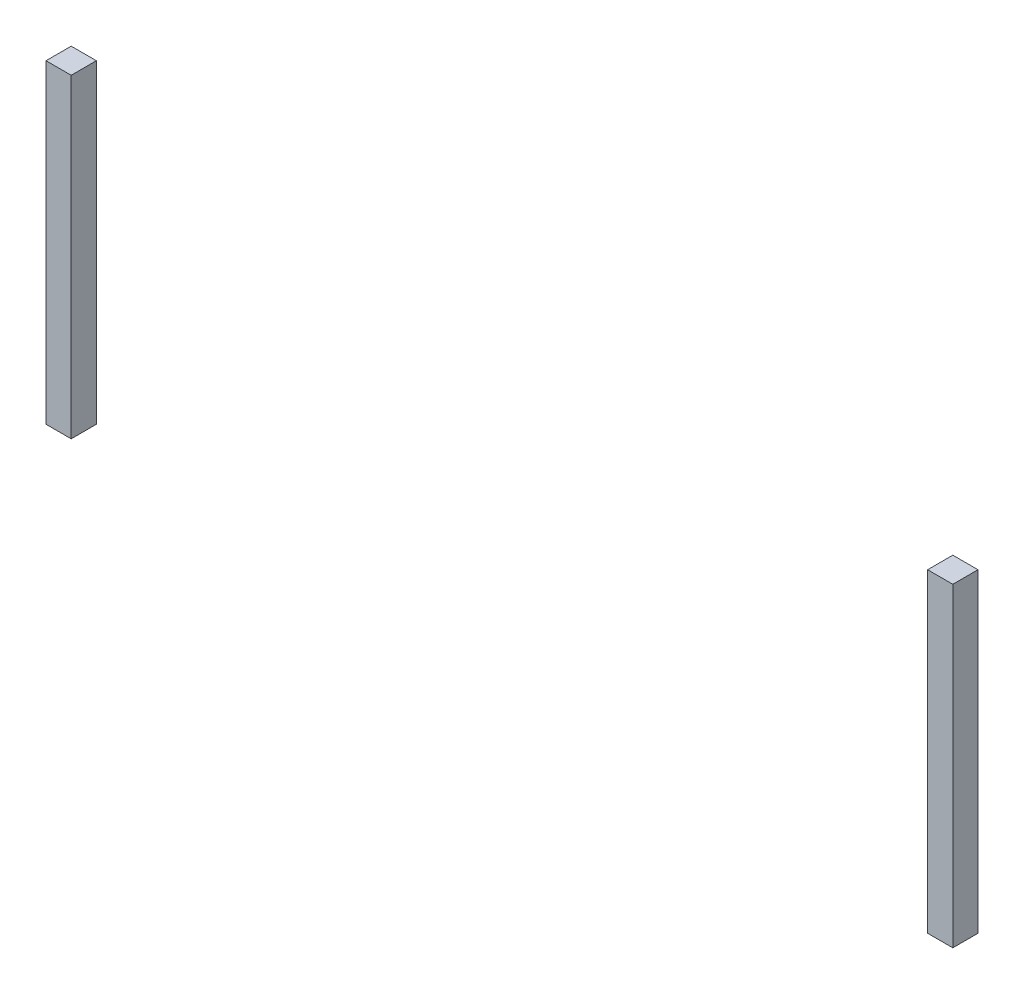
ISO-10303-21;
HEADER;
FILE_DESCRIPTION(('STEP AP214'),'2;1');
FILE_NAME('part.step','',(''),(''),'','','');
FILE_SCHEMA(('AUTOMOTIVE_DESIGN { 1 0 10303 214 1 1 1 1 }'));
ENDSEC;
DATA;
#1=APPLICATION_CONTEXT('core data for automotive mechanical design processes');
#2=APPLICATION_PROTOCOL_DEFINITION('international standard','automotive_design',2000,#1);
#3=PRODUCT_CONTEXT('',#1,'mechanical');
#4=PRODUCT('Part','Part','',(#3));
#5=PRODUCT_RELATED_PRODUCT_CATEGORY('part','',(#4));
#6=PRODUCT_DEFINITION_FORMATION('','',#4);
#7=PRODUCT_DEFINITION_CONTEXT('part definition',#1,'design');
#8=PRODUCT_DEFINITION('design','',#6,#7);
#9=PRODUCT_DEFINITION_SHAPE('','',#8);
#10=(LENGTH_UNIT() NAMED_UNIT(*) SI_UNIT(.MILLI.,.METRE.));
#11=(NAMED_UNIT(*) PLANE_ANGLE_UNIT() SI_UNIT($,.RADIAN.));
#12=(NAMED_UNIT(*) SI_UNIT($,.STERADIAN.) SOLID_ANGLE_UNIT());
#13=UNCERTAINTY_MEASURE_WITH_UNIT(LENGTH_MEASURE(1.E-05),#10,'distance_accuracy_value','');
#14=(GEOMETRIC_REPRESENTATION_CONTEXT(3) GLOBAL_UNCERTAINTY_ASSIGNED_CONTEXT((#13)) GLOBAL_UNIT_ASSIGNED_CONTEXT((#10,
#11,#12)) REPRESENTATION_CONTEXT('',''));
#15=CARTESIAN_POINT('',(0.,0.,0.));
#16=DIRECTION('',(0.,0.,1.));
#17=DIRECTION('',(1.,0.,0.));
#18=AXIS2_PLACEMENT_3D('',#15,#16,#17);
#19=CARTESIAN_POINT('',(1.7,1.25,0.));
#20=DIRECTION('',(1.,0.,0.));
#21=DIRECTION('',(0.,0.,-1.));
#22=AXIS2_PLACEMENT_3D('',#19,#20,#21);
#23=PLANE('',#22);
#24=DIRECTION('',(0.,0.,1.));
#25=VECTOR('',#24,1.);
#26=CARTESIAN_POINT('',(1.7,0.,0.));
#27=LINE('',#26,#25);
#28=CARTESIAN_POINT('',(1.7,0.,-0.0999999999999999));
#29=VERTEX_POINT('',#28);
#30=CARTESIAN_POINT('',(1.7,0.,0.));
#31=VERTEX_POINT('',#30);
#32=EDGE_CURVE('E112',#29,#31,#27,.T.);
#33=ORIENTED_EDGE('',*,*,#32,.T.);
#34=DIRECTION('',(0.,-1.,0.));
#35=VECTOR('',#34,1.);
#36=CARTESIAN_POINT('',(1.7,1.25,0.));
#37=LINE('',#36,#35);
#38=CARTESIAN_POINT('',(1.7,1.25,0.));
#39=VERTEX_POINT('',#38);
#40=EDGE_CURVE('E12',#39,#31,#37,.T.);
#41=ORIENTED_EDGE('',*,*,#40,.F.);
#42=DIRECTION('',(0.,0.,1.));
#43=VECTOR('',#42,1.);
#44=CARTESIAN_POINT('',(1.7,1.25,0.));
#45=LINE('',#44,#43);
#46=CARTESIAN_POINT('',(1.7,1.25,-0.0999999999999999));
#47=VERTEX_POINT('',#46);
#48=EDGE_CURVE('E100',#47,#39,#45,.T.);
#49=ORIENTED_EDGE('',*,*,#48,.F.);
#50=DIRECTION('',(0.,-1.,0.));
#51=VECTOR('',#50,1.);
#52=CARTESIAN_POINT('',(1.7,1.25,-0.0999999999999999));
#53=LINE('',#52,#51);
#54=EDGE_CURVE('E108',#47,#29,#53,.T.);
#55=ORIENTED_EDGE('',*,*,#54,.T.);
#56=EDGE_LOOP('',(#33,#41,#49,#55));
#57=FACE_BOUND('',#56,.T.);
#58=ADVANCED_FACE('F49',(#57),#23,.F.);
#59=CARTESIAN_POINT('',(1.7,1.25,0.));
#60=DIRECTION('',(0.,0.,-1.));
#61=DIRECTION('',(-1.,0.,0.));
#62=AXIS2_PLACEMENT_3D('',#59,#60,#61);
#63=PLANE('',#62);
#64=DIRECTION('',(1.,0.,0.));
#65=VECTOR('',#64,1.);
#66=CARTESIAN_POINT('',(1.7,0.,0.));
#67=LINE('',#66,#65);
#68=CARTESIAN_POINT('',(1.8,0.,0.));
#69=VERTEX_POINT('',#68);
#70=EDGE_CURVE('E104',#31,#69,#67,.T.);
#71=ORIENTED_EDGE('',*,*,#70,.T.);
#72=DIRECTION('',(0.,-1.,0.));
#73=VECTOR('',#72,1.);
#74=CARTESIAN_POINT('',(1.8,1.25,0.));
#75=LINE('',#74,#73);
#76=CARTESIAN_POINT('',(1.8,1.25,0.));
#77=VERTEX_POINT('',#76);
#78=EDGE_CURVE('E57',#77,#69,#75,.T.);
#79=ORIENTED_EDGE('',*,*,#78,.F.);
#80=DIRECTION('',(1.,0.,0.));
#81=VECTOR('',#80,1.);
#82=CARTESIAN_POINT('',(1.7,1.25,0.));
#83=LINE('',#82,#81);
#84=EDGE_CURVE('E95',#39,#77,#83,.T.);
#85=ORIENTED_EDGE('',*,*,#84,.F.);
#86=ORIENTED_EDGE('',*,*,#40,.T.);
#87=EDGE_LOOP('',(#71,#79,#85,#86));
#88=FACE_BOUND('',#87,.T.);
#89=ADVANCED_FACE('F103',(#88),#63,.F.);
#90=CARTESIAN_POINT('',(1.8,1.25,0.));
#91=DIRECTION('',(-1.,0.,0.));
#92=DIRECTION('',(0.,0.,1.));
#93=AXIS2_PLACEMENT_3D('',#90,#91,#92);
#94=PLANE('',#93);
#95=DIRECTION('',(0.,0.,-1.));
#96=VECTOR('',#95,1.);
#97=CARTESIAN_POINT('',(1.8,0.,0.));
#98=LINE('',#97,#96);
#99=CARTESIAN_POINT('',(1.8,0.,-0.1));
#100=VERTEX_POINT('',#99);
#101=EDGE_CURVE('E82',#69,#100,#98,.T.);
#102=ORIENTED_EDGE('',*,*,#101,.T.);
#103=DIRECTION('',(0.,-1.,0.));
#104=VECTOR('',#103,1.);
#105=CARTESIAN_POINT('',(1.8,1.25,-0.1));
#106=LINE('',#105,#104);
#107=CARTESIAN_POINT('',(1.8,1.25,-0.1));
#108=VERTEX_POINT('',#107);
#109=EDGE_CURVE('E105',#108,#100,#106,.T.);
#110=ORIENTED_EDGE('',*,*,#109,.F.);
#111=DIRECTION('',(0.,0.,-1.));
#112=VECTOR('',#111,1.);
#113=CARTESIAN_POINT('',(1.8,1.25,0.));
#114=LINE('',#113,#112);
#115=EDGE_CURVE('E98',#77,#108,#114,.T.);
#116=ORIENTED_EDGE('',*,*,#115,.F.);
#117=ORIENTED_EDGE('',*,*,#78,.T.);
#118=EDGE_LOOP('',(#102,#110,#116,#117));
#119=FACE_BOUND('',#118,.T.);
#120=ADVANCED_FACE('F106',(#119),#94,.F.);
#121=CARTESIAN_POINT('',(1.7,1.25,-0.0999999999999999));
#122=DIRECTION('',(0.,0.,1.));
#123=DIRECTION('',(1.,0.,0.));
#124=AXIS2_PLACEMENT_3D('',#121,#122,#123);
#125=PLANE('',#124);
#126=DIRECTION('',(-1.,0.,0.));
#127=VECTOR('',#126,1.);
#128=CARTESIAN_POINT('',(1.7,0.,-0.0999999999999999));
#129=LINE('',#128,#127);
#130=EDGE_CURVE('E88',#100,#29,#129,.T.);
#131=ORIENTED_EDGE('',*,*,#130,.T.);
#132=ORIENTED_EDGE('',*,*,#54,.F.);
#133=DIRECTION('',(-1.,0.,0.));
#134=VECTOR('',#133,1.);
#135=CARTESIAN_POINT('',(1.7,1.25,-0.0999999999999999));
#136=LINE('',#135,#134);
#137=EDGE_CURVE('E65',#108,#47,#136,.T.);
#138=ORIENTED_EDGE('',*,*,#137,.F.);
#139=ORIENTED_EDGE('',*,*,#109,.T.);
#140=EDGE_LOOP('',(#131,#132,#138,#139));
#141=FACE_BOUND('',#140,.T.);
#142=ADVANCED_FACE('F119',(#141),#125,.F.);
#143=CARTESIAN_POINT('',(0.,1.25,0.));
#144=DIRECTION('',(0.,-1.,0.));
#145=DIRECTION('',(0.,0.,-1.));
#146=AXIS2_PLACEMENT_3D('',#143,#144,#145);
#147=PLANE('',#146);
#148=ORIENTED_EDGE('',*,*,#48,.T.);
#149=ORIENTED_EDGE('',*,*,#84,.T.);
#150=ORIENTED_EDGE('',*,*,#115,.T.);
#151=ORIENTED_EDGE('',*,*,#137,.T.);
#152=EDGE_LOOP('',(#148,#149,#150,#151));
#153=FACE_BOUND('',#152,.T.);
#154=ADVANCED_FACE('F96',(#153),#147,.F.);
#155=CARTESIAN_POINT('',(0.,0.,0.));
#156=DIRECTION('',(0.,-1.,0.));
#157=DIRECTION('',(0.,0.,-1.));
#158=AXIS2_PLACEMENT_3D('',#155,#156,#157);
#159=PLANE('',#158);
#160=ORIENTED_EDGE('',*,*,#32,.F.);
#161=ORIENTED_EDGE('',*,*,#130,.F.);
#162=ORIENTED_EDGE('',*,*,#101,.F.);
#163=ORIENTED_EDGE('',*,*,#70,.F.);
#164=EDGE_LOOP('',(#160,#161,#162,#163));
#165=FACE_BOUND('',#164,.T.);
#166=ADVANCED_FACE('F122',(#165),#159,.T.);
#167=CLOSED_SHELL('',(#58,#89,#120,#142,#154,#166));
#168=MANIFOLD_SOLID_BREP('B2',#167);
#169=CARTESIAN_POINT('',(-1.7,1.25,0.));
#170=DIRECTION('',(-1.,0.,0.));
#171=DIRECTION('',(0.,0.,1.));
#172=AXIS2_PLACEMENT_3D('',#169,#170,#171);
#173=PLANE('',#172);
#174=DIRECTION('',(0.,0.,-1.));
#175=VECTOR('',#174,1.);
#176=CARTESIAN_POINT('',(-1.7,0.,0.));
#177=LINE('',#176,#175);
#178=CARTESIAN_POINT('',(-1.7,0.,0.));
#179=VERTEX_POINT('',#178);
#180=CARTESIAN_POINT('',(-1.7,0.,-0.1));
#181=VERTEX_POINT('',#180);
#182=EDGE_CURVE('E241',#179,#181,#177,.T.);
#183=ORIENTED_EDGE('',*,*,#182,.T.);
#184=DIRECTION('',(0.,-1.,0.));
#185=VECTOR('',#184,1.);
#186=CARTESIAN_POINT('',(-1.7,1.25,-0.1));
#187=LINE('',#186,#185);
#188=CARTESIAN_POINT('',(-1.7,1.25,-0.1));
#189=VERTEX_POINT('',#188);
#190=EDGE_CURVE('E47',#189,#181,#187,.T.);
#191=ORIENTED_EDGE('',*,*,#190,.F.);
#192=DIRECTION('',(0.,0.,-1.));
#193=VECTOR('',#192,1.);
#194=CARTESIAN_POINT('',(-1.7,1.25,0.));
#195=LINE('',#194,#193);
#196=CARTESIAN_POINT('',(-1.7,1.25,0.));
#197=VERTEX_POINT('',#196);
#198=EDGE_CURVE('E225',#197,#189,#195,.T.);
#199=ORIENTED_EDGE('',*,*,#198,.F.);
#200=DIRECTION('',(0.,-1.,0.));
#201=VECTOR('',#200,1.);
#202=CARTESIAN_POINT('',(-1.7,1.25,0.));
#203=LINE('',#202,#201);
#204=EDGE_CURVE('E237',#197,#179,#203,.T.);
#205=ORIENTED_EDGE('',*,*,#204,.T.);
#206=EDGE_LOOP('',(#183,#191,#199,#205));
#207=FACE_BOUND('',#206,.T.);
#208=ADVANCED_FACE('F173',(#207),#173,.F.);
#209=CARTESIAN_POINT('',(-1.7,1.25,-0.1));
#210=DIRECTION('',(0.,0.,1.));
#211=DIRECTION('',(1.,0.,0.));
#212=AXIS2_PLACEMENT_3D('',#209,#210,#211);
#213=PLANE('',#212);
#214=DIRECTION('',(-1.,0.,0.));
#215=VECTOR('',#214,1.);
#216=CARTESIAN_POINT('',(-1.7,0.,-0.1));
#217=LINE('',#216,#215);
#218=CARTESIAN_POINT('',(-1.8,0.,-0.0999999999999999));
#219=VERTEX_POINT('',#218);
#220=EDGE_CURVE('E230',#181,#219,#217,.T.);
#221=ORIENTED_EDGE('',*,*,#220,.T.);
#222=DIRECTION('',(0.,-1.,0.));
#223=VECTOR('',#222,1.);
#224=CARTESIAN_POINT('',(-1.8,1.25,-0.0999999999999999));
#225=LINE('',#224,#223);
#226=CARTESIAN_POINT('',(-1.8,1.25,-0.0999999999999999));
#227=VERTEX_POINT('',#226);
#228=EDGE_CURVE('E182',#227,#219,#225,.T.);
#229=ORIENTED_EDGE('',*,*,#228,.F.);
#230=DIRECTION('',(-1.,0.,0.));
#231=VECTOR('',#230,1.);
#232=CARTESIAN_POINT('',(-1.7,1.25,-0.1));
#233=LINE('',#232,#231);
#234=EDGE_CURVE('E220',#189,#227,#233,.T.);
#235=ORIENTED_EDGE('',*,*,#234,.F.);
#236=ORIENTED_EDGE('',*,*,#190,.T.);
#237=EDGE_LOOP('',(#221,#229,#235,#236));
#238=FACE_BOUND('',#237,.T.);
#239=ADVANCED_FACE('F229',(#238),#213,.F.);
#240=CARTESIAN_POINT('',(-1.8,1.25,0.));
#241=DIRECTION('',(1.,0.,0.));
#242=DIRECTION('',(0.,0.,-1.));
#243=AXIS2_PLACEMENT_3D('',#240,#241,#242);
#244=PLANE('',#243);
#245=DIRECTION('',(0.,0.,1.));
#246=VECTOR('',#245,1.);
#247=CARTESIAN_POINT('',(-1.8,0.,0.));
#248=LINE('',#247,#246);
#249=CARTESIAN_POINT('',(-1.8,0.,0.));
#250=VERTEX_POINT('',#249);
#251=EDGE_CURVE('E207',#219,#250,#248,.T.);
#252=ORIENTED_EDGE('',*,*,#251,.T.);
#253=DIRECTION('',(0.,-1.,0.));
#254=VECTOR('',#253,1.);
#255=CARTESIAN_POINT('',(-1.8,1.25,0.));
#256=LINE('',#255,#254);
#257=CARTESIAN_POINT('',(-1.8,1.25,0.));
#258=VERTEX_POINT('',#257);
#259=EDGE_CURVE('E232',#258,#250,#256,.T.);
#260=ORIENTED_EDGE('',*,*,#259,.F.);
#261=DIRECTION('',(0.,0.,1.));
#262=VECTOR('',#261,1.);
#263=CARTESIAN_POINT('',(-1.8,1.25,0.));
#264=LINE('',#263,#262);
#265=EDGE_CURVE('E223',#227,#258,#264,.T.);
#266=ORIENTED_EDGE('',*,*,#265,.F.);
#267=ORIENTED_EDGE('',*,*,#228,.T.);
#268=EDGE_LOOP('',(#252,#260,#266,#267));
#269=FACE_BOUND('',#268,.T.);
#270=ADVANCED_FACE('F233',(#269),#244,.F.);
#271=CARTESIAN_POINT('',(-1.7,1.25,0.));
#272=DIRECTION('',(0.,0.,-1.));
#273=DIRECTION('',(-1.,0.,0.));
#274=AXIS2_PLACEMENT_3D('',#271,#272,#273);
#275=PLANE('',#274);
#276=DIRECTION('',(1.,0.,0.));
#277=VECTOR('',#276,1.);
#278=CARTESIAN_POINT('',(-1.7,0.,0.));
#279=LINE('',#278,#277);
#280=EDGE_CURVE('E213',#250,#179,#279,.T.);
#281=ORIENTED_EDGE('',*,*,#280,.T.);
#282=ORIENTED_EDGE('',*,*,#204,.F.);
#283=DIRECTION('',(1.,0.,0.));
#284=VECTOR('',#283,1.);
#285=CARTESIAN_POINT('',(-1.7,1.25,0.));
#286=LINE('',#285,#284);
#287=EDGE_CURVE('E190',#258,#197,#286,.T.);
#288=ORIENTED_EDGE('',*,*,#287,.F.);
#289=ORIENTED_EDGE('',*,*,#259,.T.);
#290=EDGE_LOOP('',(#281,#282,#288,#289));
#291=FACE_BOUND('',#290,.T.);
#292=ADVANCED_FACE('F254',(#291),#275,.F.);
#293=CARTESIAN_POINT('',(0.,1.25,0.));
#294=DIRECTION('',(0.,1.,0.));
#295=DIRECTION('',(0.,0.,1.));
#296=AXIS2_PLACEMENT_3D('',#293,#294,#295);
#297=PLANE('',#296);
#298=ORIENTED_EDGE('',*,*,#198,.T.);
#299=ORIENTED_EDGE('',*,*,#234,.T.);
#300=ORIENTED_EDGE('',*,*,#265,.T.);
#301=ORIENTED_EDGE('',*,*,#287,.T.);
#302=EDGE_LOOP('',(#298,#299,#300,#301));
#303=FACE_BOUND('',#302,.T.);
#304=ADVANCED_FACE('F221',(#303),#297,.T.);
#305=CARTESIAN_POINT('',(0.,0.,0.));
#306=DIRECTION('',(0.,1.,0.));
#307=DIRECTION('',(0.,0.,1.));
#308=AXIS2_PLACEMENT_3D('',#305,#306,#307);
#309=PLANE('',#308);
#310=ORIENTED_EDGE('',*,*,#182,.F.);
#311=ORIENTED_EDGE('',*,*,#280,.F.);
#312=ORIENTED_EDGE('',*,*,#251,.F.);
#313=ORIENTED_EDGE('',*,*,#220,.F.);
#314=EDGE_LOOP('',(#310,#311,#312,#313));
#315=FACE_BOUND('',#314,.T.);
#316=ADVANCED_FACE('F257',(#315),#309,.F.);
#317=CLOSED_SHELL('',(#208,#239,#270,#292,#304,#316));
#318=MANIFOLD_SOLID_BREP('B6',#317);
#319=ADVANCED_BREP_SHAPE_REPRESENTATION('',(#18,#168,#318),#14);
#320=SHAPE_DEFINITION_REPRESENTATION(#9,#319);
ENDSEC;
END-ISO-10303-21;
